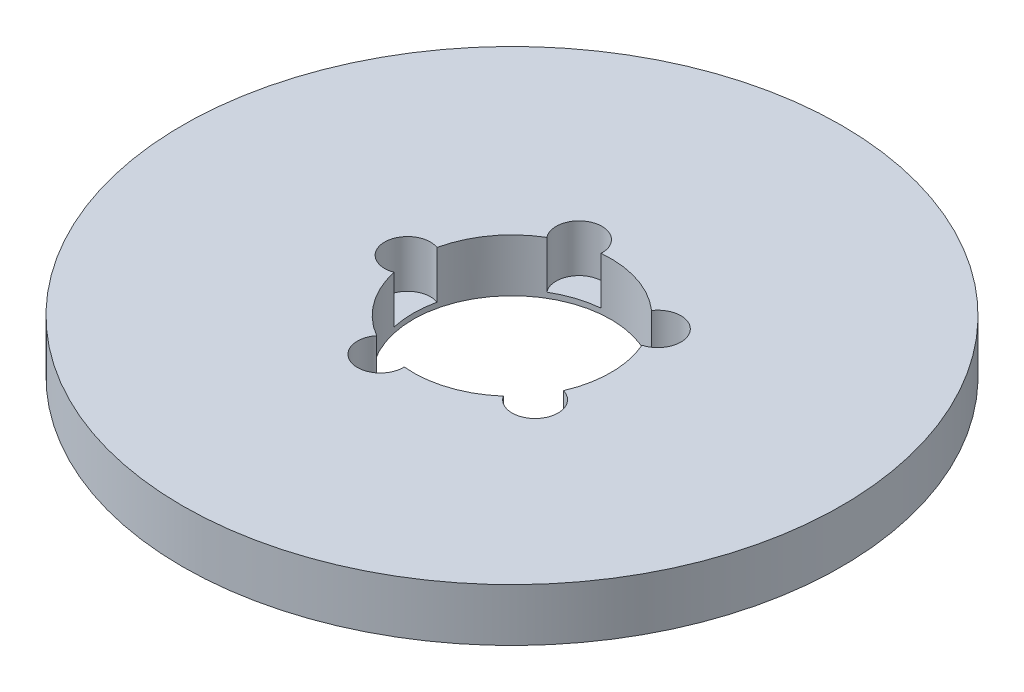
ISO-10303-21;
HEADER;
FILE_DESCRIPTION(('STEP AP214'),'2;1');
FILE_NAME('part.step','',(''),(''),'','','');
FILE_SCHEMA(('AUTOMOTIVE_DESIGN { 1 0 10303 214 1 1 1 1 }'));
ENDSEC;
DATA;
#1=APPLICATION_CONTEXT('core data for automotive mechanical design processes');
#2=APPLICATION_PROTOCOL_DEFINITION('international standard','automotive_design',2000,#1);
#3=PRODUCT_CONTEXT('',#1,'mechanical');
#4=PRODUCT('Part','Part','',(#3));
#5=PRODUCT_RELATED_PRODUCT_CATEGORY('part','',(#4));
#6=PRODUCT_DEFINITION_FORMATION('','',#4);
#7=PRODUCT_DEFINITION_CONTEXT('part definition',#1,'design');
#8=PRODUCT_DEFINITION('design','',#6,#7);
#9=PRODUCT_DEFINITION_SHAPE('','',#8);
#10=(LENGTH_UNIT() NAMED_UNIT(*) SI_UNIT(.MILLI.,.METRE.));
#11=(NAMED_UNIT(*) PLANE_ANGLE_UNIT() SI_UNIT($,.RADIAN.));
#12=(NAMED_UNIT(*) SI_UNIT($,.STERADIAN.) SOLID_ANGLE_UNIT());
#13=UNCERTAINTY_MEASURE_WITH_UNIT(LENGTH_MEASURE(1.E-05),#10,'distance_accuracy_value','');
#14=(GEOMETRIC_REPRESENTATION_CONTEXT(3) GLOBAL_UNCERTAINTY_ASSIGNED_CONTEXT((#13)) GLOBAL_UNIT_ASSIGNED_CONTEXT((#10,
#11,#12)) REPRESENTATION_CONTEXT('',''));
#15=CARTESIAN_POINT('',(0.,0.,0.));
#16=DIRECTION('',(0.,0.,1.));
#17=DIRECTION('',(1.,0.,0.));
#18=AXIS2_PLACEMENT_3D('',#15,#16,#17);
#19=CARTESIAN_POINT('',(0.,4.,0.));
#20=DIRECTION('',(0.,-1.,0.));
#21=DIRECTION('',(0.,0.,-1.));
#22=AXIS2_PLACEMENT_3D('',#19,#20,#21);
#23=CYLINDRICAL_SURFACE('',#22,25.);
#24=CARTESIAN_POINT('',(0.,4.,0.));
#25=DIRECTION('',(0.,1.,0.));
#26=DIRECTION('',(0.,0.,1.));
#27=AXIS2_PLACEMENT_3D('',#24,#25,#26);
#28=CIRCLE('',#27,25.);
#29=CARTESIAN_POINT('',(0.,4.,25.));
#30=VERTEX_POINT('',#29);
#31=EDGE_CURVE('E157',#30,#30,#28,.T.);
#32=ORIENTED_EDGE('',*,*,#31,.F.);
#33=EDGE_LOOP('',(#32));
#34=FACE_BOUND('',#33,.T.);
#35=CARTESIAN_POINT('',(0.,0.,0.));
#36=DIRECTION('',(0.,1.,0.));
#37=DIRECTION('',(0.,0.,1.));
#38=AXIS2_PLACEMENT_3D('',#35,#36,#37);
#39=CIRCLE('',#38,25.);
#40=CARTESIAN_POINT('',(0.,0.,25.));
#41=VERTEX_POINT('',#40);
#42=EDGE_CURVE('E150',#41,#41,#39,.T.);
#43=ORIENTED_EDGE('',*,*,#42,.T.);
#44=EDGE_LOOP('',(#43));
#45=FACE_BOUND('',#44,.T.);
#46=ADVANCED_FACE('F39',(#34,#45),#23,.T.);
#47=CARTESIAN_POINT('',(0.,4.,0.));
#48=DIRECTION('',(0.,1.,0.));
#49=DIRECTION('',(0.,0.,1.));
#50=AXIS2_PLACEMENT_3D('',#47,#48,#49);
#51=PLANE('',#50);
#52=CARTESIAN_POINT('',(-2.44861638203769,4.,-7.53606632785475));
#53=DIRECTION('',(0.,1.,0.));
#54=DIRECTION('',(-0.95105651629515,0.,0.309016994374958));
#55=AXIS2_PLACEMENT_3D('',#52,#53,#54);
#56=CIRCLE('',#55,1.74074640025107);
#57=CARTESIAN_POINT('',(-0.709265095582668,4.,-7.46638754848609));
#58=VERTEX_POINT('',#57);
#59=CARTESIAN_POINT('',(-3.81482497305707,4.,-6.45732997646396));
#60=VERTEX_POINT('',#59);
#61=EDGE_CURVE('E194',#58,#60,#56,.T.);
#62=ORIENTED_EDGE('',*,*,#61,.F.);
#63=CARTESIAN_POINT('',(0.,4.,0.));
#64=DIRECTION('',(0.,1.,0.));
#65=DIRECTION('',(0.,0.,1.));
#66=AXIS2_PLACEMENT_3D('',#63,#64,#65);
#67=CIRCLE('',#66,7.5);
#68=CARTESIAN_POINT('',(4.96244000474351,4.,-5.62353885016554));
#69=VERTEX_POINT('',#68);
#70=EDGE_CURVE('E147',#69,#58,#67,.T.);
#71=ORIENTED_EDGE('',*,*,#70,.F.);
#72=CARTESIAN_POINT('',(6.41056091358421,4.,-4.65754513208792));
#73=DIRECTION('',(0.,1.,0.));
#74=DIRECTION('',(-0.58778525229248,0.,-0.809016994374942));
#75=AXIS2_PLACEMENT_3D('',#72,#73,#74);
#76=CIRCLE('',#75,1.74074640025107);
#77=CARTESIAN_POINT('',(6.88178156312068,4.,-2.98179183000629));
#78=VERTEX_POINT('',#77);
#79=EDGE_CURVE('E254',#78,#69,#76,.T.);
#80=ORIENTED_EDGE('',*,*,#79,.F.);
#81=CARTESIAN_POINT('',(6.88178156312072,4.,2.98179183000619));
#82=VERTEX_POINT('',#81);
#83=EDGE_CURVE('E144',#82,#78,#67,.T.);
#84=ORIENTED_EDGE('',*,*,#83,.F.);
#85=CARTESIAN_POINT('',(6.41056091358428,4.,4.65754513208782));
#86=DIRECTION('',(0.,1.,0.));
#87=DIRECTION('',(0.587785252292469,0.,-0.809016994374951));
#88=AXIS2_PLACEMENT_3D('',#85,#86,#87);
#89=CIRCLE('',#88,1.74074640025107);
#90=CARTESIAN_POINT('',(4.96244000474359,4.,5.62353885016547));
#91=VERTEX_POINT('',#90);
#92=EDGE_CURVE('E141',#91,#82,#89,.T.);
#93=ORIENTED_EDGE('',*,*,#92,.F.);
#94=CARTESIAN_POINT('',(-0.709265095582563,4.,7.4663875484861));
#95=VERTEX_POINT('',#94);
#96=EDGE_CURVE('E134',#95,#91,#67,.T.);
#97=ORIENTED_EDGE('',*,*,#96,.F.);
#98=CARTESIAN_POINT('',(-2.44861638203759,4.,7.53606632785479));
#99=DIRECTION('',(0.,1.,0.));
#100=DIRECTION('',(0.951056516295155,0.,0.309016994374945));
#101=AXIS2_PLACEMENT_3D('',#98,#99,#100);
#102=CIRCLE('',#101,1.74074640025107);
#103=CARTESIAN_POINT('',(-3.81482497305698,4.,6.45732997646402));
#104=VERTEX_POINT('',#103);
#105=EDGE_CURVE('E111',#104,#95,#102,.T.);
#106=ORIENTED_EDGE('',*,*,#105,.F.);
#107=CARTESIAN_POINT('',(-7.32013149922469,4.,1.63268944813718));
#108=VERTEX_POINT('',#107);
#109=EDGE_CURVE('E145',#108,#104,#67,.T.);
#110=ORIENTED_EDGE('',*,*,#109,.F.);
#111=CARTESIAN_POINT('',(-7.92388906309329,4.,0.));
#112=DIRECTION('',(0.,1.,0.));
#113=DIRECTION('',(0.,0.,1.));
#114=AXIS2_PLACEMENT_3D('',#111,#112,#113);
#115=CIRCLE('',#114,1.74074640025107);
#116=CARTESIAN_POINT('',(-7.32013149922469,4.,-1.63268944813718));
#117=VERTEX_POINT('',#116);
#118=EDGE_CURVE('E153',#117,#108,#115,.T.);
#119=ORIENTED_EDGE('',*,*,#118,.F.);
#120=EDGE_CURVE('E146',#60,#117,#67,.T.);
#121=ORIENTED_EDGE('',*,*,#120,.F.);
#122=EDGE_LOOP('',(#62,#71,#80,#84,#93,#97,#106,#110,#119,#121));
#123=FACE_BOUND('',#122,.T.);
#124=ORIENTED_EDGE('',*,*,#31,.T.);
#125=EDGE_LOOP('',(#124));
#126=FACE_BOUND('',#125,.T.);
#127=ADVANCED_FACE('F139',(#123,#126),#51,.T.);
#128=CARTESIAN_POINT('',(0.,0.,0.));
#129=DIRECTION('',(0.,1.,0.));
#130=DIRECTION('',(0.,0.,1.));
#131=AXIS2_PLACEMENT_3D('',#128,#129,#130);
#132=PLANE('',#131);
#133=CARTESIAN_POINT('',(0.,0.,0.));
#134=DIRECTION('',(0.,1.,0.));
#135=DIRECTION('',(0.,0.,1.));
#136=AXIS2_PLACEMENT_3D('',#133,#134,#135);
#137=CIRCLE('',#136,7.5);
#138=CARTESIAN_POINT('',(0.,0.,7.5));
#139=VERTEX_POINT('',#138);
#140=EDGE_CURVE('E154',#139,#139,#137,.T.);
#141=ORIENTED_EDGE('',*,*,#140,.T.);
#142=EDGE_LOOP('',(#141));
#143=FACE_BOUND('',#142,.T.);
#144=ORIENTED_EDGE('',*,*,#42,.F.);
#145=EDGE_LOOP('',(#144));
#146=FACE_BOUND('',#145,.T.);
#147=ADVANCED_FACE('F213',(#143,#146),#132,.F.);
#148=CARTESIAN_POINT('',(0.,4.,0.));
#149=DIRECTION('',(0.,-1.,0.));
#150=DIRECTION('',(0.,0.,-1.));
#151=AXIS2_PLACEMENT_3D('',#148,#149,#150);
#152=CYLINDRICAL_SURFACE('',#151,7.5);
#153=DIRECTION('',(0.,1.,0.));
#154=VECTOR('',#153,1.);
#155=CARTESIAN_POINT('',(-0.709265095582668,2.20106132869122,-7.46638754848609));
#156=LINE('',#155,#154);
#157=CARTESIAN_POINT('',(-0.709265095582668,0.402122657382434,-7.46638754848609));
#158=VERTEX_POINT('',#157);
#159=EDGE_CURVE('E11',#158,#58,#156,.T.);
#160=ORIENTED_EDGE('',*,*,#159,.F.);
#161=CARTESIAN_POINT('',(0.,0.402122657382434,0.));
#162=DIRECTION('',(0.,1.,0.));
#163=DIRECTION('',(0.,0.,1.));
#164=AXIS2_PLACEMENT_3D('',#161,#162,#163);
#165=CIRCLE('',#164,7.5);
#166=CARTESIAN_POINT('',(-3.81482497305707,0.402122657382434,-6.45732997646396));
#167=VERTEX_POINT('',#166);
#168=EDGE_CURVE('E189',#158,#167,#165,.T.);
#169=ORIENTED_EDGE('',*,*,#168,.T.);
#170=DIRECTION('',(0.,1.,0.));
#171=VECTOR('',#170,1.);
#172=CARTESIAN_POINT('',(-3.81482497305707,2.20106132869122,-6.45732997646396));
#173=LINE('',#172,#171);
#174=EDGE_CURVE('E46',#60,#167,#173,.F.);
#175=ORIENTED_EDGE('',*,*,#174,.F.);
#176=ORIENTED_EDGE('',*,*,#120,.T.);
#177=DIRECTION('',(0.,1.,0.));
#178=VECTOR('',#177,1.);
#179=CARTESIAN_POINT('',(-7.32013149922469,2.20106132869122,-1.63268944813718));
#180=LINE('',#179,#178);
#181=CARTESIAN_POINT('',(-7.32013149922469,0.402122657382434,-1.63268944813718));
#182=VERTEX_POINT('',#181);
#183=EDGE_CURVE('E168',#182,#117,#180,.T.);
#184=ORIENTED_EDGE('',*,*,#183,.F.);
#185=CARTESIAN_POINT('',(0.,0.402122657382434,0.));
#186=DIRECTION('',(0.,1.,0.));
#187=DIRECTION('',(0.,0.,1.));
#188=AXIS2_PLACEMENT_3D('',#185,#186,#187);
#189=CIRCLE('',#188,7.5);
#190=CARTESIAN_POINT('',(-7.32013149922469,0.402122657382434,1.63268944813718));
#191=VERTEX_POINT('',#190);
#192=EDGE_CURVE('E165',#182,#191,#189,.T.);
#193=ORIENTED_EDGE('',*,*,#192,.T.);
#194=DIRECTION('',(0.,1.,0.));
#195=VECTOR('',#194,1.);
#196=CARTESIAN_POINT('',(-7.32013149922469,2.20106132869122,1.63268944813718));
#197=LINE('',#196,#195);
#198=EDGE_CURVE('E170',#108,#191,#197,.F.);
#199=ORIENTED_EDGE('',*,*,#198,.F.);
#200=ORIENTED_EDGE('',*,*,#109,.T.);
#201=DIRECTION('',(0.,1.,0.));
#202=VECTOR('',#201,1.);
#203=CARTESIAN_POINT('',(-3.81482497305698,2.20106132869122,6.45732997646402));
#204=LINE('',#203,#202);
#205=CARTESIAN_POINT('',(-3.81482497305698,0.402122657382434,6.45732997646402));
#206=VERTEX_POINT('',#205);
#207=EDGE_CURVE('E121',#206,#104,#204,.T.);
#208=ORIENTED_EDGE('',*,*,#207,.F.);
#209=CARTESIAN_POINT('',(0.,0.402122657382434,0.));
#210=DIRECTION('',(0.,1.,0.));
#211=DIRECTION('',(0.,0.,1.));
#212=AXIS2_PLACEMENT_3D('',#209,#210,#211);
#213=CIRCLE('',#212,7.5);
#214=CARTESIAN_POINT('',(-0.709265095582563,0.402122657382434,7.4663875484861));
#215=VERTEX_POINT('',#214);
#216=EDGE_CURVE('E136',#206,#215,#213,.T.);
#217=ORIENTED_EDGE('',*,*,#216,.T.);
#218=DIRECTION('',(0.,1.,0.));
#219=VECTOR('',#218,1.);
#220=CARTESIAN_POINT('',(-0.709265095582563,2.20106132869122,7.4663875484861));
#221=LINE('',#220,#219);
#222=EDGE_CURVE('E117',#95,#215,#221,.F.);
#223=ORIENTED_EDGE('',*,*,#222,.F.);
#224=ORIENTED_EDGE('',*,*,#96,.T.);
#225=DIRECTION('',(0.,1.,0.));
#226=VECTOR('',#225,1.);
#227=CARTESIAN_POINT('',(4.96244000474359,2.20106132869122,5.62353885016547));
#228=LINE('',#227,#226);
#229=CARTESIAN_POINT('',(4.96244000474359,0.402122657382434,5.62353885016547));
#230=VERTEX_POINT('',#229);
#231=EDGE_CURVE('E182',#230,#91,#228,.T.);
#232=ORIENTED_EDGE('',*,*,#231,.F.);
#233=CARTESIAN_POINT('',(0.,0.402122657382434,0.));
#234=DIRECTION('',(0.,1.,0.));
#235=DIRECTION('',(0.,0.,1.));
#236=AXIS2_PLACEMENT_3D('',#233,#234,#235);
#237=CIRCLE('',#236,7.5);
#238=CARTESIAN_POINT('',(6.88178156312072,0.402122657382434,2.98179183000619));
#239=VERTEX_POINT('',#238);
#240=EDGE_CURVE('E174',#230,#239,#237,.T.);
#241=ORIENTED_EDGE('',*,*,#240,.T.);
#242=DIRECTION('',(0.,1.,0.));
#243=VECTOR('',#242,1.);
#244=CARTESIAN_POINT('',(6.88178156312073,2.20106132869122,2.98179183000619));
#245=LINE('',#244,#243);
#246=EDGE_CURVE('E177',#82,#239,#245,.F.);
#247=ORIENTED_EDGE('',*,*,#246,.F.);
#248=ORIENTED_EDGE('',*,*,#83,.T.);
#249=DIRECTION('',(0.,1.,0.));
#250=VECTOR('',#249,1.);
#251=CARTESIAN_POINT('',(6.88178156312068,2.20106132869122,-2.98179183000629));
#252=LINE('',#251,#250);
#253=CARTESIAN_POINT('',(6.88178156312068,0.402122657382434,-2.98179183000629));
#254=VERTEX_POINT('',#253);
#255=EDGE_CURVE('E187',#254,#78,#252,.T.);
#256=ORIENTED_EDGE('',*,*,#255,.F.);
#257=CARTESIAN_POINT('',(0.,0.402122657382434,0.));
#258=DIRECTION('',(0.,1.,0.));
#259=DIRECTION('',(0.,0.,1.));
#260=AXIS2_PLACEMENT_3D('',#257,#258,#259);
#261=CIRCLE('',#260,7.5);
#262=CARTESIAN_POINT('',(4.96244000474351,0.402122657382434,-5.62353885016554));
#263=VERTEX_POINT('',#262);
#264=EDGE_CURVE('E181',#254,#263,#261,.T.);
#265=ORIENTED_EDGE('',*,*,#264,.T.);
#266=DIRECTION('',(0.,1.,0.));
#267=VECTOR('',#266,1.);
#268=CARTESIAN_POINT('',(4.96244000474351,2.20106132869122,-5.62353885016554));
#269=LINE('',#268,#267);
#270=EDGE_CURVE('E186',#69,#263,#269,.F.);
#271=ORIENTED_EDGE('',*,*,#270,.F.);
#272=ORIENTED_EDGE('',*,*,#70,.T.);
#273=EDGE_LOOP('',(#160,#169,#175,#176,#184,#193,#199,#200,#208,#217,#223,#224,#232,#241,#247,
#248,#256,#265,#271,#272));
#274=FACE_BOUND('',#273,.T.);
#275=ORIENTED_EDGE('',*,*,#140,.F.);
#276=EDGE_LOOP('',(#275));
#277=FACE_BOUND('',#276,.T.);
#278=ADVANCED_FACE('F135',(#274,#277),#152,.F.);
#279=CARTESIAN_POINT('',(-7.92388906309329,0.402122657382434,0.));
#280=DIRECTION('',(0.,1.,0.));
#281=DIRECTION('',(0.,0.,1.));
#282=AXIS2_PLACEMENT_3D('',#279,#280,#281);
#283=CYLINDRICAL_SURFACE('',#282,1.74074640025107);
#284=ORIENTED_EDGE('',*,*,#183,.T.);
#285=ORIENTED_EDGE('',*,*,#118,.T.);
#286=ORIENTED_EDGE('',*,*,#198,.T.);
#287=CARTESIAN_POINT('',(-7.92388906309329,0.402122657382434,0.));
#288=DIRECTION('',(0.,1.,0.));
#289=DIRECTION('',(0.,0.,1.));
#290=AXIS2_PLACEMENT_3D('',#287,#288,#289);
#291=CIRCLE('',#290,1.74074640025107);
#292=EDGE_CURVE('E158',#182,#191,#291,.T.);
#293=ORIENTED_EDGE('',*,*,#292,.F.);
#294=EDGE_LOOP('',(#284,#285,#286,#293));
#295=FACE_BOUND('',#294,.T.);
#296=ADVANCED_FACE('F221',(#295),#283,.F.);
#297=CARTESIAN_POINT('',(-7.92388906309329,0.402122657382434,0.));
#298=DIRECTION('',(0.,1.,0.));
#299=DIRECTION('',(0.,0.,1.));
#300=AXIS2_PLACEMENT_3D('',#297,#298,#299);
#301=PLANE('',#300);
#302=ORIENTED_EDGE('',*,*,#292,.T.);
#303=ORIENTED_EDGE('',*,*,#192,.F.);
#304=EDGE_LOOP('',(#302,#303));
#305=FACE_BOUND('',#304,.T.);
#306=ADVANCED_FACE('F227',(#305),#301,.T.);
#307=CARTESIAN_POINT('',(-2.44861638203759,0.402122657382434,7.53606632785479));
#308=DIRECTION('',(0.,1.,0.));
#309=DIRECTION('',(0.,0.,1.));
#310=AXIS2_PLACEMENT_3D('',#307,#308,#309);
#311=CYLINDRICAL_SURFACE('',#310,1.74074640025107);
#312=ORIENTED_EDGE('',*,*,#207,.T.);
#313=ORIENTED_EDGE('',*,*,#105,.T.);
#314=ORIENTED_EDGE('',*,*,#222,.T.);
#315=CARTESIAN_POINT('',(-2.44861638203759,0.402122657382434,7.53606632785479));
#316=DIRECTION('',(0.,1.,0.));
#317=DIRECTION('',(0.951056516295155,0.,0.309016994374945));
#318=AXIS2_PLACEMENT_3D('',#315,#316,#317);
#319=CIRCLE('',#318,1.74074640025107);
#320=EDGE_CURVE('E127',#206,#215,#319,.T.);
#321=ORIENTED_EDGE('',*,*,#320,.F.);
#322=EDGE_LOOP('',(#312,#313,#314,#321));
#323=FACE_BOUND('',#322,.T.);
#324=ADVANCED_FACE('F116',(#323),#311,.F.);
#325=CARTESIAN_POINT('',(-2.44861638203759,0.402122657382434,7.53606632785479));
#326=DIRECTION('',(0.,1.,0.));
#327=DIRECTION('',(0.951056516295155,0.,0.309016994374945));
#328=AXIS2_PLACEMENT_3D('',#325,#326,#327);
#329=PLANE('',#328);
#330=ORIENTED_EDGE('',*,*,#320,.T.);
#331=ORIENTED_EDGE('',*,*,#216,.F.);
#332=EDGE_LOOP('',(#330,#331));
#333=FACE_BOUND('',#332,.T.);
#334=ADVANCED_FACE('F234',(#333),#329,.T.);
#335=CARTESIAN_POINT('',(6.41056091358428,0.402122657382434,4.65754513208782));
#336=DIRECTION('',(0.,1.,0.));
#337=DIRECTION('',(0.,0.,1.));
#338=AXIS2_PLACEMENT_3D('',#335,#336,#337);
#339=CYLINDRICAL_SURFACE('',#338,1.74074640025107);
#340=ORIENTED_EDGE('',*,*,#231,.T.);
#341=ORIENTED_EDGE('',*,*,#92,.T.);
#342=ORIENTED_EDGE('',*,*,#246,.T.);
#343=CARTESIAN_POINT('',(6.41056091358428,0.402122657382434,4.65754513208782));
#344=DIRECTION('',(0.,1.,0.));
#345=DIRECTION('',(0.587785252292469,0.,-0.809016994374951));
#346=AXIS2_PLACEMENT_3D('',#343,#344,#345);
#347=CIRCLE('',#346,1.74074640025107);
#348=EDGE_CURVE('E130',#230,#239,#347,.T.);
#349=ORIENTED_EDGE('',*,*,#348,.F.);
#350=EDGE_LOOP('',(#340,#341,#342,#349));
#351=FACE_BOUND('',#350,.T.);
#352=ADVANCED_FACE('F240',(#351),#339,.F.);
#353=CARTESIAN_POINT('',(6.41056091358428,0.402122657382434,4.65754513208782));
#354=DIRECTION('',(0.,1.,0.));
#355=DIRECTION('',(0.587785252292469,0.,-0.809016994374951));
#356=AXIS2_PLACEMENT_3D('',#353,#354,#355);
#357=PLANE('',#356);
#358=ORIENTED_EDGE('',*,*,#348,.T.);
#359=ORIENTED_EDGE('',*,*,#240,.F.);
#360=EDGE_LOOP('',(#358,#359));
#361=FACE_BOUND('',#360,.T.);
#362=ADVANCED_FACE('F245',(#361),#357,.T.);
#363=CARTESIAN_POINT('',(6.41056091358421,0.402122657382434,-4.65754513208792));
#364=DIRECTION('',(0.,1.,0.));
#365=DIRECTION('',(0.,0.,1.));
#366=AXIS2_PLACEMENT_3D('',#363,#364,#365);
#367=CYLINDRICAL_SURFACE('',#366,1.74074640025107);
#368=ORIENTED_EDGE('',*,*,#255,.T.);
#369=ORIENTED_EDGE('',*,*,#79,.T.);
#370=ORIENTED_EDGE('',*,*,#270,.T.);
#371=CARTESIAN_POINT('',(6.41056091358421,0.402122657382434,-4.65754513208792));
#372=DIRECTION('',(0.,1.,0.));
#373=DIRECTION('',(-0.58778525229248,0.,-0.809016994374942));
#374=AXIS2_PLACEMENT_3D('',#371,#372,#373);
#375=CIRCLE('',#374,1.74074640025107);
#376=EDGE_CURVE('E56',#254,#263,#375,.T.);
#377=ORIENTED_EDGE('',*,*,#376,.F.);
#378=EDGE_LOOP('',(#368,#369,#370,#377));
#379=FACE_BOUND('',#378,.T.);
#380=ADVANCED_FACE('F266',(#379),#367,.F.);
#381=CARTESIAN_POINT('',(6.41056091358421,0.402122657382434,-4.65754513208792));
#382=DIRECTION('',(0.,1.,0.));
#383=DIRECTION('',(-0.58778525229248,0.,-0.809016994374942));
#384=AXIS2_PLACEMENT_3D('',#381,#382,#383);
#385=PLANE('',#384);
#386=ORIENTED_EDGE('',*,*,#376,.T.);
#387=ORIENTED_EDGE('',*,*,#264,.F.);
#388=EDGE_LOOP('',(#386,#387));
#389=FACE_BOUND('',#388,.T.);
#390=ADVANCED_FACE('F204',(#389),#385,.T.);
#391=CARTESIAN_POINT('',(-2.44861638203769,0.402122657382434,-7.53606632785475));
#392=DIRECTION('',(0.,1.,0.));
#393=DIRECTION('',(0.,0.,1.));
#394=AXIS2_PLACEMENT_3D('',#391,#392,#393);
#395=CYLINDRICAL_SURFACE('',#394,1.74074640025107);
#396=ORIENTED_EDGE('',*,*,#159,.T.);
#397=ORIENTED_EDGE('',*,*,#61,.T.);
#398=ORIENTED_EDGE('',*,*,#174,.T.);
#399=CARTESIAN_POINT('',(-2.44861638203769,0.402122657382434,-7.53606632785475));
#400=DIRECTION('',(0.,1.,0.));
#401=DIRECTION('',(-0.95105651629515,0.,0.309016994374958));
#402=AXIS2_PLACEMENT_3D('',#399,#400,#401);
#403=CIRCLE('',#402,1.74074640025107);
#404=EDGE_CURVE('E55',#158,#167,#403,.T.);
#405=ORIENTED_EDGE('',*,*,#404,.F.);
#406=EDGE_LOOP('',(#396,#397,#398,#405));
#407=FACE_BOUND('',#406,.T.);
#408=ADVANCED_FACE('F193',(#407),#395,.F.);
#409=CARTESIAN_POINT('',(-2.44861638203769,0.402122657382434,-7.53606632785475));
#410=DIRECTION('',(0.,1.,0.));
#411=DIRECTION('',(-0.95105651629515,0.,0.309016994374958));
#412=AXIS2_PLACEMENT_3D('',#409,#410,#411);
#413=PLANE('',#412);
#414=ORIENTED_EDGE('',*,*,#404,.T.);
#415=ORIENTED_EDGE('',*,*,#168,.F.);
#416=EDGE_LOOP('',(#414,#415));
#417=FACE_BOUND('',#416,.T.);
#418=ADVANCED_FACE('F196',(#417),#413,.T.);
#419=CLOSED_SHELL('',(#46,#127,#147,#278,#296,#306,#324,#334,#352,#362,#380,#390,#408,#418));
#420=MANIFOLD_SOLID_BREP('B2',#419);
#421=ADVANCED_BREP_SHAPE_REPRESENTATION('',(#18,#420),#14);
#422=SHAPE_DEFINITION_REPRESENTATION(#9,#421);
ENDSEC;
END-ISO-10303-21;
